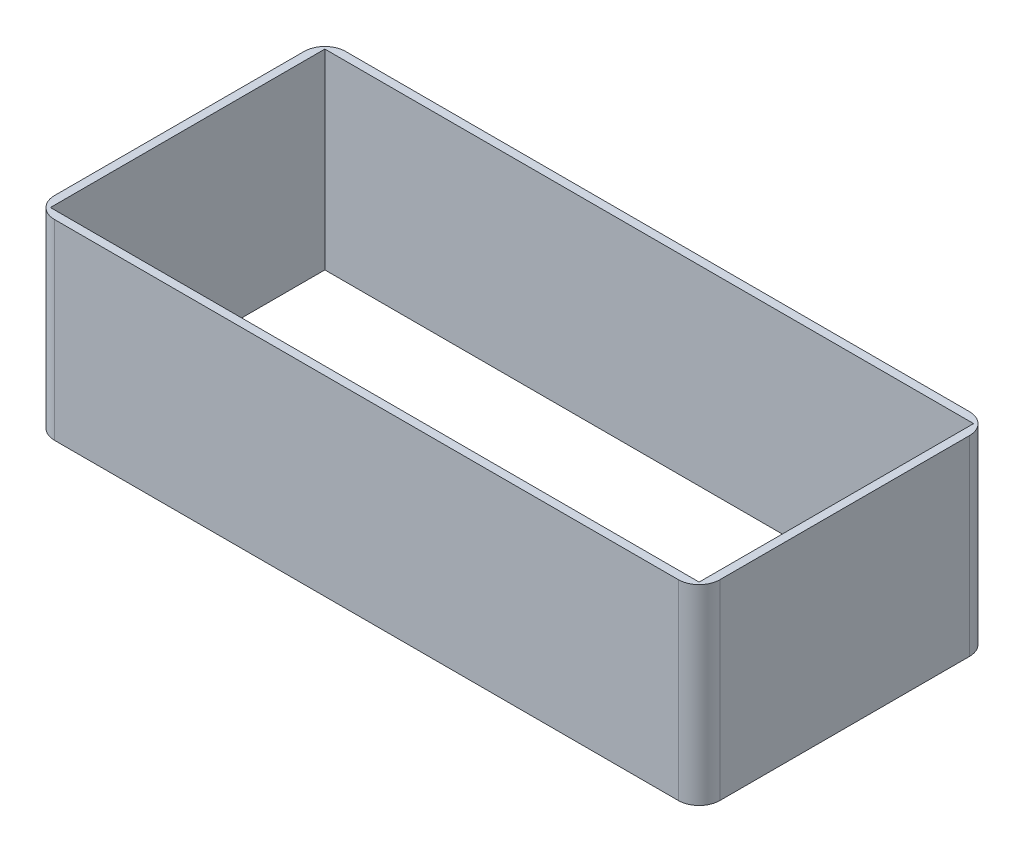
ISO-10303-21;
HEADER;
FILE_DESCRIPTION(('STEP AP214'),'2;1');
FILE_NAME('part.step','',(''),(''),'','','');
FILE_SCHEMA(('AUTOMOTIVE_DESIGN { 1 0 10303 214 1 1 1 1 }'));
ENDSEC;
DATA;
#1=APPLICATION_CONTEXT('core data for automotive mechanical design processes');
#2=APPLICATION_PROTOCOL_DEFINITION('international standard','automotive_design',2000,#1);
#3=PRODUCT_CONTEXT('',#1,'mechanical');
#4=PRODUCT('Part','Part','',(#3));
#5=PRODUCT_RELATED_PRODUCT_CATEGORY('part','',(#4));
#6=PRODUCT_DEFINITION_FORMATION('','',#4);
#7=PRODUCT_DEFINITION_CONTEXT('part definition',#1,'design');
#8=PRODUCT_DEFINITION('design','',#6,#7);
#9=PRODUCT_DEFINITION_SHAPE('','',#8);
#10=(LENGTH_UNIT() NAMED_UNIT(*) SI_UNIT(.MILLI.,.METRE.));
#11=(NAMED_UNIT(*) PLANE_ANGLE_UNIT() SI_UNIT($,.RADIAN.));
#12=(NAMED_UNIT(*) SI_UNIT($,.STERADIAN.) SOLID_ANGLE_UNIT());
#13=UNCERTAINTY_MEASURE_WITH_UNIT(LENGTH_MEASURE(1.E-05),#10,'distance_accuracy_value','');
#14=(GEOMETRIC_REPRESENTATION_CONTEXT(3) GLOBAL_UNCERTAINTY_ASSIGNED_CONTEXT((#13)) GLOBAL_UNIT_ASSIGNED_CONTEXT((#10,
#11,#12)) REPRESENTATION_CONTEXT('',''));
#15=CARTESIAN_POINT('',(0.,0.,0.));
#16=DIRECTION('',(0.,0.,1.));
#17=DIRECTION('',(1.,0.,0.));
#18=AXIS2_PLACEMENT_3D('',#15,#16,#17);
#19=CARTESIAN_POINT('',(0.,2.,0.));
#20=DIRECTION('',(0.,-1.,0.));
#21=DIRECTION('',(0.,0.,-1.));
#22=AXIS2_PLACEMENT_3D('',#19,#20,#21);
#23=PLANE('',#22);
#24=DIRECTION('',(1.,0.,0.));
#25=VECTOR('',#24,1.);
#26=CARTESIAN_POINT('',(-98.3544303797468,2.,20.1518987341772));
#27=LINE('',#26,#25);
#28=CARTESIAN_POINT('',(-96.3544303797468,2.,20.1518987341772));
#29=VERTEX_POINT('',#28);
#30=CARTESIAN_POINT('',(59.6455696202532,2.,20.1518987341772));
#31=VERTEX_POINT('',#30);
#32=EDGE_CURVE('E145',#29,#31,#27,.T.);
#33=ORIENTED_EDGE('',*,*,#32,.T.);
#34=DIRECTION('',(0.,0.,-1.));
#35=VECTOR('',#34,1.);
#36=CARTESIAN_POINT('',(59.6455696202532,2.,-47.8481012658228));
#37=LINE('',#36,#35);
#38=CARTESIAN_POINT('',(59.6455696202532,2.,-45.8481012658228));
#39=VERTEX_POINT('',#38);
#40=EDGE_CURVE('E129',#31,#39,#37,.T.);
#41=ORIENTED_EDGE('',*,*,#40,.T.);
#42=DIRECTION('',(-1.,0.,0.));
#43=VECTOR('',#42,1.);
#44=CARTESIAN_POINT('',(-98.3544303797468,2.,-45.8481012658228));
#45=LINE('',#44,#43);
#46=CARTESIAN_POINT('',(-96.3544303797468,2.,-45.8481012658228));
#47=VERTEX_POINT('',#46);
#48=EDGE_CURVE('E135',#39,#47,#45,.T.);
#49=ORIENTED_EDGE('',*,*,#48,.T.);
#50=DIRECTION('',(0.,0.,1.));
#51=VECTOR('',#50,1.);
#52=CARTESIAN_POINT('',(-96.3544303797468,2.,-47.8481012658228));
#53=LINE('',#52,#51);
#54=EDGE_CURVE('E147',#47,#29,#53,.T.);
#55=ORIENTED_EDGE('',*,*,#54,.T.);
#56=EDGE_LOOP('',(#33,#41,#49,#55));
#57=FACE_BOUND('',#56,.T.);
#58=CARTESIAN_POINT('',(-93.3544303797468,2.,-42.8481012658228));
#59=DIRECTION('',(0.,-1.,0.));
#60=DIRECTION('',(0.,0.,-1.));
#61=AXIS2_PLACEMENT_3D('',#58,#59,#60);
#62=CIRCLE('',#61,5.);
#63=CARTESIAN_POINT('',(-93.3544303797468,2.,-47.8481012658228));
#64=VERTEX_POINT('',#63);
#65=CARTESIAN_POINT('',(-98.3544303797468,2.,-42.8481012658228));
#66=VERTEX_POINT('',#65);
#67=EDGE_CURVE('E198',#64,#66,#62,.F.);
#68=ORIENTED_EDGE('',*,*,#67,.F.);
#69=DIRECTION('',(1.,0.,0.));
#70=VECTOR('',#69,1.);
#71=CARTESIAN_POINT('',(-98.3544303797468,2.,-47.8481012658228));
#72=LINE('',#71,#70);
#73=CARTESIAN_POINT('',(56.6455696202532,2.,-47.8481012658228));
#74=VERTEX_POINT('',#73);
#75=EDGE_CURVE('E141',#64,#74,#72,.T.);
#76=ORIENTED_EDGE('',*,*,#75,.T.);
#77=CARTESIAN_POINT('',(56.6455696202532,2.,-42.8481012658228));
#78=DIRECTION('',(0.,-1.,0.));
#79=DIRECTION('',(0.,0.,-1.));
#80=AXIS2_PLACEMENT_3D('',#77,#78,#79);
#81=CIRCLE('',#80,5.);
#82=CARTESIAN_POINT('',(61.6455696202532,2.,-42.8481012658228));
#83=VERTEX_POINT('',#82);
#84=EDGE_CURVE('E201',#83,#74,#81,.F.);
#85=ORIENTED_EDGE('',*,*,#84,.F.);
#86=DIRECTION('',(0.,0.,1.));
#87=VECTOR('',#86,1.);
#88=CARTESIAN_POINT('',(61.6455696202532,2.,-47.8481012658228));
#89=LINE('',#88,#87);
#90=CARTESIAN_POINT('',(61.6455696202532,2.,17.1518987341772));
#91=VERTEX_POINT('',#90);
#92=EDGE_CURVE('E181',#83,#91,#89,.T.);
#93=ORIENTED_EDGE('',*,*,#92,.T.);
#94=CARTESIAN_POINT('',(56.6455696202532,2.,17.1518987341772));
#95=DIRECTION('',(0.,-1.,0.));
#96=DIRECTION('',(0.,0.,-1.));
#97=AXIS2_PLACEMENT_3D('',#94,#95,#96);
#98=CIRCLE('',#97,5.);
#99=CARTESIAN_POINT('',(56.6455696202532,2.,22.1518987341772));
#100=VERTEX_POINT('',#99);
#101=EDGE_CURVE('E177',#100,#91,#98,.F.);
#102=ORIENTED_EDGE('',*,*,#101,.F.);
#103=DIRECTION('',(-1.,0.,0.));
#104=VECTOR('',#103,1.);
#105=CARTESIAN_POINT('',(-98.3544303797468,2.,22.1518987341772));
#106=LINE('',#105,#104);
#107=CARTESIAN_POINT('',(-93.3544303797468,2.,22.1518987341772));
#108=VERTEX_POINT('',#107);
#109=EDGE_CURVE('E189',#100,#108,#106,.T.);
#110=ORIENTED_EDGE('',*,*,#109,.T.);
#111=CARTESIAN_POINT('',(-93.3544303797468,2.,17.1518987341772));
#112=DIRECTION('',(0.,-1.,0.));
#113=DIRECTION('',(0.,0.,-1.));
#114=AXIS2_PLACEMENT_3D('',#111,#112,#113);
#115=CIRCLE('',#114,5.);
#116=CARTESIAN_POINT('',(-98.3544303797468,2.,17.1518987341772));
#117=VERTEX_POINT('',#116);
#118=EDGE_CURVE('E195',#117,#108,#115,.F.);
#119=ORIENTED_EDGE('',*,*,#118,.F.);
#120=DIRECTION('',(0.,0.,-1.));
#121=VECTOR('',#120,1.);
#122=CARTESIAN_POINT('',(-98.3544303797468,2.,-47.8481012658228));
#123=LINE('',#122,#121);
#124=EDGE_CURVE('E185',#117,#66,#123,.T.);
#125=ORIENTED_EDGE('',*,*,#124,.T.);
#126=EDGE_LOOP('',(#68,#76,#85,#93,#102,#110,#119,#125));
#127=FACE_BOUND('',#126,.T.);
#128=ADVANCED_FACE('F35',(#57,#127),#23,.T.);
#129=CARTESIAN_POINT('',(0.,48.,0.));
#130=DIRECTION('',(0.,1.,0.));
#131=DIRECTION('',(0.,0.,1.));
#132=AXIS2_PLACEMENT_3D('',#129,#130,#131);
#133=PLANE('',#132);
#134=DIRECTION('',(0.,0.,1.));
#135=VECTOR('',#134,1.);
#136=CARTESIAN_POINT('',(-96.3544303797468,48.,-47.8481012658228));
#137=LINE('',#136,#135);
#138=CARTESIAN_POINT('',(-96.3544303797468,48.,-45.8481012658228));
#139=VERTEX_POINT('',#138);
#140=CARTESIAN_POINT('',(-96.3544303797468,48.,20.1518987341772));
#141=VERTEX_POINT('',#140);
#142=EDGE_CURVE('E155',#139,#141,#137,.T.);
#143=ORIENTED_EDGE('',*,*,#142,.F.);
#144=DIRECTION('',(-1.,0.,0.));
#145=VECTOR('',#144,1.);
#146=CARTESIAN_POINT('',(-98.3544303797468,48.,-45.8481012658228));
#147=LINE('',#146,#145);
#148=CARTESIAN_POINT('',(59.6455696202532,48.,-45.8481012658228));
#149=VERTEX_POINT('',#148);
#150=EDGE_CURVE('E39',#149,#139,#147,.T.);
#151=ORIENTED_EDGE('',*,*,#150,.F.);
#152=DIRECTION('',(0.,0.,-1.));
#153=VECTOR('',#152,1.);
#154=CARTESIAN_POINT('',(59.6455696202532,48.,-47.8481012658228));
#155=LINE('',#154,#153);
#156=CARTESIAN_POINT('',(59.6455696202532,48.,20.1518987341772));
#157=VERTEX_POINT('',#156);
#158=EDGE_CURVE('E52',#157,#149,#155,.T.);
#159=ORIENTED_EDGE('',*,*,#158,.F.);
#160=DIRECTION('',(1.,0.,0.));
#161=VECTOR('',#160,1.);
#162=CARTESIAN_POINT('',(-98.3544303797468,48.,20.1518987341772));
#163=LINE('',#162,#161);
#164=EDGE_CURVE('E56',#141,#157,#163,.T.);
#165=ORIENTED_EDGE('',*,*,#164,.F.);
#166=EDGE_LOOP('',(#143,#151,#159,#165));
#167=FACE_BOUND('',#166,.T.);
#168=CARTESIAN_POINT('',(-93.3544303797468,48.,-42.8481012658228));
#169=DIRECTION('',(0.,1.,0.));
#170=DIRECTION('',(0.,0.,1.));
#171=AXIS2_PLACEMENT_3D('',#168,#169,#170);
#172=CIRCLE('',#171,5.);
#173=CARTESIAN_POINT('',(-98.3544303797468,48.,-42.8481012658228));
#174=VERTEX_POINT('',#173);
#175=CARTESIAN_POINT('',(-93.3544303797468,48.,-47.8481012658228));
#176=VERTEX_POINT('',#175);
#177=EDGE_CURVE('E196',#174,#176,#172,.F.);
#178=ORIENTED_EDGE('',*,*,#177,.F.);
#179=DIRECTION('',(0.,0.,1.));
#180=VECTOR('',#179,1.);
#181=CARTESIAN_POINT('',(-98.3544303797468,48.,-47.8481012658228));
#182=LINE('',#181,#180);
#183=CARTESIAN_POINT('',(-98.3544303797468,48.,17.1518987341772));
#184=VERTEX_POINT('',#183);
#185=EDGE_CURVE('E186',#174,#184,#182,.T.);
#186=ORIENTED_EDGE('',*,*,#185,.T.);
#187=CARTESIAN_POINT('',(-93.3544303797468,48.,17.1518987341772));
#188=DIRECTION('',(0.,1.,0.));
#189=DIRECTION('',(0.,0.,1.));
#190=AXIS2_PLACEMENT_3D('',#187,#188,#189);
#191=CIRCLE('',#190,5.);
#192=CARTESIAN_POINT('',(-93.3544303797468,48.,22.1518987341772));
#193=VERTEX_POINT('',#192);
#194=EDGE_CURVE('E193',#193,#184,#191,.F.);
#195=ORIENTED_EDGE('',*,*,#194,.F.);
#196=DIRECTION('',(1.,0.,0.));
#197=VECTOR('',#196,1.);
#198=CARTESIAN_POINT('',(-98.3544303797468,48.,22.1518987341772));
#199=LINE('',#198,#197);
#200=CARTESIAN_POINT('',(56.6455696202532,48.,22.1518987341772));
#201=VERTEX_POINT('',#200);
#202=EDGE_CURVE('E190',#193,#201,#199,.T.);
#203=ORIENTED_EDGE('',*,*,#202,.T.);
#204=CARTESIAN_POINT('',(56.6455696202532,48.,17.1518987341772));
#205=DIRECTION('',(0.,1.,0.));
#206=DIRECTION('',(0.,0.,1.));
#207=AXIS2_PLACEMENT_3D('',#204,#205,#206);
#208=CIRCLE('',#207,5.);
#209=CARTESIAN_POINT('',(61.6455696202532,48.,17.1518987341772));
#210=VERTEX_POINT('',#209);
#211=EDGE_CURVE('E202',#210,#201,#208,.F.);
#212=ORIENTED_EDGE('',*,*,#211,.F.);
#213=DIRECTION('',(0.,0.,-1.));
#214=VECTOR('',#213,1.);
#215=CARTESIAN_POINT('',(61.6455696202532,48.,-47.8481012658228));
#216=LINE('',#215,#214);
#217=CARTESIAN_POINT('',(61.6455696202532,48.,-42.8481012658228));
#218=VERTEX_POINT('',#217);
#219=EDGE_CURVE('E182',#210,#218,#216,.T.);
#220=ORIENTED_EDGE('',*,*,#219,.T.);
#221=CARTESIAN_POINT('',(56.6455696202532,48.,-42.8481012658228));
#222=DIRECTION('',(0.,1.,0.));
#223=DIRECTION('',(0.,0.,1.));
#224=AXIS2_PLACEMENT_3D('',#221,#222,#223);
#225=CIRCLE('',#224,5.);
#226=CARTESIAN_POINT('',(56.6455696202532,48.,-47.8481012658228));
#227=VERTEX_POINT('',#226);
#228=EDGE_CURVE('E199',#227,#218,#225,.F.);
#229=ORIENTED_EDGE('',*,*,#228,.F.);
#230=DIRECTION('',(-1.,0.,0.));
#231=VECTOR('',#230,1.);
#232=CARTESIAN_POINT('',(-98.3544303797468,48.,-47.8481012658228));
#233=LINE('',#232,#231);
#234=EDGE_CURVE('E178',#227,#176,#233,.T.);
#235=ORIENTED_EDGE('',*,*,#234,.T.);
#236=EDGE_LOOP('',(#178,#186,#195,#203,#212,#220,#229,#235));
#237=FACE_BOUND('',#236,.T.);
#238=ADVANCED_FACE('F240',(#167,#237),#133,.T.);
#239=CARTESIAN_POINT('',(-98.3544303797468,48.,-45.8481012658228));
#240=DIRECTION('',(0.,0.,1.));
#241=DIRECTION('',(1.,0.,0.));
#242=AXIS2_PLACEMENT_3D('',#239,#240,#241);
#243=PLANE('',#242);
#244=ORIENTED_EDGE('',*,*,#48,.F.);
#245=DIRECTION('',(0.,-1.,0.));
#246=VECTOR('',#245,1.);
#247=CARTESIAN_POINT('',(59.6455696202532,48.,-45.8481012658228));
#248=LINE('',#247,#246);
#249=EDGE_CURVE('E124',#149,#39,#248,.T.);
#250=ORIENTED_EDGE('',*,*,#249,.F.);
#251=ORIENTED_EDGE('',*,*,#150,.T.);
#252=DIRECTION('',(0.,-1.,0.));
#253=VECTOR('',#252,1.);
#254=CARTESIAN_POINT('',(-96.3544303797468,48.,-45.8481012658228));
#255=LINE('',#254,#253);
#256=EDGE_CURVE('E132',#139,#47,#255,.T.);
#257=ORIENTED_EDGE('',*,*,#256,.T.);
#258=EDGE_LOOP('',(#244,#250,#251,#257));
#259=FACE_BOUND('',#258,.T.);
#260=ADVANCED_FACE('F136',(#259),#243,.T.);
#261=CARTESIAN_POINT('',(59.6455696202532,48.,-47.8481012658228));
#262=DIRECTION('',(-1.,0.,0.));
#263=DIRECTION('',(0.,0.,1.));
#264=AXIS2_PLACEMENT_3D('',#261,#262,#263);
#265=PLANE('',#264);
#266=ORIENTED_EDGE('',*,*,#40,.F.);
#267=DIRECTION('',(0.,-1.,0.));
#268=VECTOR('',#267,1.);
#269=CARTESIAN_POINT('',(59.6455696202532,48.,20.1518987341772));
#270=LINE('',#269,#268);
#271=EDGE_CURVE('E44',#157,#31,#270,.T.);
#272=ORIENTED_EDGE('',*,*,#271,.F.);
#273=ORIENTED_EDGE('',*,*,#158,.T.);
#274=ORIENTED_EDGE('',*,*,#249,.T.);
#275=EDGE_LOOP('',(#266,#272,#273,#274));
#276=FACE_BOUND('',#275,.T.);
#277=ADVANCED_FACE('F126',(#276),#265,.T.);
#278=CARTESIAN_POINT('',(-96.3544303797468,48.,-47.8481012658228));
#279=DIRECTION('',(1.,0.,0.));
#280=DIRECTION('',(0.,0.,-1.));
#281=AXIS2_PLACEMENT_3D('',#278,#279,#280);
#282=PLANE('',#281);
#283=ORIENTED_EDGE('',*,*,#54,.F.);
#284=ORIENTED_EDGE('',*,*,#256,.F.);
#285=ORIENTED_EDGE('',*,*,#142,.T.);
#286=DIRECTION('',(0.,-1.,0.));
#287=VECTOR('',#286,1.);
#288=CARTESIAN_POINT('',(-96.3544303797468,48.,20.1518987341772));
#289=LINE('',#288,#287);
#290=EDGE_CURVE('E11',#141,#29,#289,.T.);
#291=ORIENTED_EDGE('',*,*,#290,.T.);
#292=EDGE_LOOP('',(#283,#284,#285,#291));
#293=FACE_BOUND('',#292,.T.);
#294=ADVANCED_FACE('F265',(#293),#282,.T.);
#295=CARTESIAN_POINT('',(-98.3544303797468,48.,20.1518987341772));
#296=DIRECTION('',(0.,0.,-1.));
#297=DIRECTION('',(-1.,0.,0.));
#298=AXIS2_PLACEMENT_3D('',#295,#296,#297);
#299=PLANE('',#298);
#300=ORIENTED_EDGE('',*,*,#32,.F.);
#301=ORIENTED_EDGE('',*,*,#290,.F.);
#302=ORIENTED_EDGE('',*,*,#164,.T.);
#303=ORIENTED_EDGE('',*,*,#271,.T.);
#304=EDGE_LOOP('',(#300,#301,#302,#303));
#305=FACE_BOUND('',#304,.T.);
#306=ADVANCED_FACE('F269',(#305),#299,.T.);
#307=CARTESIAN_POINT('',(-98.3544303797468,50.,22.1518987341772));
#308=DIRECTION('',(0.,0.,-1.));
#309=DIRECTION('',(-1.,0.,0.));
#310=AXIS2_PLACEMENT_3D('',#307,#308,#309);
#311=PLANE('',#310);
#312=ORIENTED_EDGE('',*,*,#202,.F.);
#313=DIRECTION('',(0.,-1.,0.));
#314=VECTOR('',#313,1.);
#315=CARTESIAN_POINT('',(-93.3544303797468,50.,22.1518987341772));
#316=LINE('',#315,#314);
#317=EDGE_CURVE('E156',#193,#108,#316,.T.);
#318=ORIENTED_EDGE('',*,*,#317,.T.);
#319=ORIENTED_EDGE('',*,*,#109,.F.);
#320=DIRECTION('',(0.,-1.,0.));
#321=VECTOR('',#320,1.);
#322=CARTESIAN_POINT('',(56.6455696202532,50.,22.1518987341772));
#323=LINE('',#322,#321);
#324=EDGE_CURVE('E152',#100,#201,#323,.F.);
#325=ORIENTED_EDGE('',*,*,#324,.T.);
#326=EDGE_LOOP('',(#312,#318,#319,#325));
#327=FACE_BOUND('',#326,.T.);
#328=ADVANCED_FACE('F237',(#327),#311,.F.);
#329=CARTESIAN_POINT('',(61.6455696202532,50.,-47.8481012658228));
#330=DIRECTION('',(-1.,0.,0.));
#331=DIRECTION('',(0.,0.,1.));
#332=AXIS2_PLACEMENT_3D('',#329,#330,#331);
#333=PLANE('',#332);
#334=ORIENTED_EDGE('',*,*,#219,.F.);
#335=DIRECTION('',(0.,-1.,0.));
#336=VECTOR('',#335,1.);
#337=CARTESIAN_POINT('',(61.6455696202532,50.,17.1518987341772));
#338=LINE('',#337,#336);
#339=EDGE_CURVE('E171',#210,#91,#338,.T.);
#340=ORIENTED_EDGE('',*,*,#339,.T.);
#341=ORIENTED_EDGE('',*,*,#92,.F.);
#342=DIRECTION('',(0.,-1.,0.));
#343=VECTOR('',#342,1.);
#344=CARTESIAN_POINT('',(61.6455696202532,50.,-42.8481012658228));
#345=LINE('',#344,#343);
#346=EDGE_CURVE('E174',#83,#218,#345,.F.);
#347=ORIENTED_EDGE('',*,*,#346,.T.);
#348=EDGE_LOOP('',(#334,#340,#341,#347));
#349=FACE_BOUND('',#348,.T.);
#350=ADVANCED_FACE('F230',(#349),#333,.F.);
#351=CARTESIAN_POINT('',(56.6455696202532,50.,17.1518987341772));
#352=DIRECTION('',(0.,-1.,0.));
#353=DIRECTION('',(0.,0.,-1.));
#354=AXIS2_PLACEMENT_3D('',#351,#352,#353);
#355=CYLINDRICAL_SURFACE('',#354,5.);
#356=ORIENTED_EDGE('',*,*,#339,.F.);
#357=ORIENTED_EDGE('',*,*,#211,.T.);
#358=ORIENTED_EDGE('',*,*,#324,.F.);
#359=ORIENTED_EDGE('',*,*,#101,.T.);
#360=EDGE_LOOP('',(#356,#357,#358,#359));
#361=FACE_BOUND('',#360,.T.);
#362=ADVANCED_FACE('F37',(#361),#355,.T.);
#363=CARTESIAN_POINT('',(-98.3544303797468,50.,-47.8481012658228));
#364=DIRECTION('',(0.,0.,1.));
#365=DIRECTION('',(1.,0.,0.));
#366=AXIS2_PLACEMENT_3D('',#363,#364,#365);
#367=PLANE('',#366);
#368=ORIENTED_EDGE('',*,*,#234,.F.);
#369=DIRECTION('',(0.,-1.,0.));
#370=VECTOR('',#369,1.);
#371=CARTESIAN_POINT('',(56.6455696202532,50.,-47.8481012658228));
#372=LINE('',#371,#370);
#373=EDGE_CURVE('E165',#227,#74,#372,.T.);
#374=ORIENTED_EDGE('',*,*,#373,.T.);
#375=ORIENTED_EDGE('',*,*,#75,.F.);
#376=DIRECTION('',(0.,-1.,0.));
#377=VECTOR('',#376,1.);
#378=CARTESIAN_POINT('',(-93.3544303797468,50.,-47.8481012658228));
#379=LINE('',#378,#377);
#380=EDGE_CURVE('E168',#64,#176,#379,.F.);
#381=ORIENTED_EDGE('',*,*,#380,.T.);
#382=EDGE_LOOP('',(#368,#374,#375,#381));
#383=FACE_BOUND('',#382,.T.);
#384=ADVANCED_FACE('F224',(#383),#367,.F.);
#385=CARTESIAN_POINT('',(56.6455696202532,50.,-42.8481012658228));
#386=DIRECTION('',(0.,-1.,0.));
#387=DIRECTION('',(0.,0.,-1.));
#388=AXIS2_PLACEMENT_3D('',#385,#386,#387);
#389=CYLINDRICAL_SURFACE('',#388,5.);
#390=ORIENTED_EDGE('',*,*,#373,.F.);
#391=ORIENTED_EDGE('',*,*,#228,.T.);
#392=ORIENTED_EDGE('',*,*,#346,.F.);
#393=ORIENTED_EDGE('',*,*,#84,.T.);
#394=EDGE_LOOP('',(#390,#391,#392,#393));
#395=FACE_BOUND('',#394,.T.);
#396=ADVANCED_FACE('F226',(#395),#389,.T.);
#397=CARTESIAN_POINT('',(-98.3544303797468,50.,-47.8481012658228));
#398=DIRECTION('',(1.,0.,0.));
#399=DIRECTION('',(0.,0.,-1.));
#400=AXIS2_PLACEMENT_3D('',#397,#398,#399);
#401=PLANE('',#400);
#402=ORIENTED_EDGE('',*,*,#185,.F.);
#403=DIRECTION('',(0.,-1.,0.));
#404=VECTOR('',#403,1.);
#405=CARTESIAN_POINT('',(-98.3544303797468,50.,-42.8481012658228));
#406=LINE('',#405,#404);
#407=EDGE_CURVE('E159',#174,#66,#406,.T.);
#408=ORIENTED_EDGE('',*,*,#407,.T.);
#409=ORIENTED_EDGE('',*,*,#124,.F.);
#410=DIRECTION('',(0.,-1.,0.));
#411=VECTOR('',#410,1.);
#412=CARTESIAN_POINT('',(-98.3544303797468,50.,17.1518987341772));
#413=LINE('',#412,#411);
#414=EDGE_CURVE('E162',#117,#184,#413,.F.);
#415=ORIENTED_EDGE('',*,*,#414,.T.);
#416=EDGE_LOOP('',(#402,#408,#409,#415));
#417=FACE_BOUND('',#416,.T.);
#418=ADVANCED_FACE('F247',(#417),#401,.F.);
#419=CARTESIAN_POINT('',(-93.3544303797468,50.,-42.8481012658228));
#420=DIRECTION('',(0.,-1.,0.));
#421=DIRECTION('',(0.,0.,-1.));
#422=AXIS2_PLACEMENT_3D('',#419,#420,#421);
#423=CYLINDRICAL_SURFACE('',#422,5.);
#424=ORIENTED_EDGE('',*,*,#407,.F.);
#425=ORIENTED_EDGE('',*,*,#177,.T.);
#426=ORIENTED_EDGE('',*,*,#380,.F.);
#427=ORIENTED_EDGE('',*,*,#67,.T.);
#428=EDGE_LOOP('',(#424,#425,#426,#427));
#429=FACE_BOUND('',#428,.T.);
#430=ADVANCED_FACE('F250',(#429),#423,.T.);
#431=CARTESIAN_POINT('',(-93.3544303797468,50.,17.1518987341772));
#432=DIRECTION('',(0.,-1.,0.));
#433=DIRECTION('',(0.,0.,-1.));
#434=AXIS2_PLACEMENT_3D('',#431,#432,#433);
#435=CYLINDRICAL_SURFACE('',#434,5.);
#436=ORIENTED_EDGE('',*,*,#317,.F.);
#437=ORIENTED_EDGE('',*,*,#194,.T.);
#438=ORIENTED_EDGE('',*,*,#414,.F.);
#439=ORIENTED_EDGE('',*,*,#118,.T.);
#440=EDGE_LOOP('',(#436,#437,#438,#439));
#441=FACE_BOUND('',#440,.T.);
#442=ADVANCED_FACE('F242',(#441),#435,.T.);
#443=CLOSED_SHELL('',(#128,#238,#260,#277,#294,#306,#328,#350,#362,#384,#396,#418,#430,#442));
#444=MANIFOLD_SOLID_BREP('B2',#443);
#445=ADVANCED_BREP_SHAPE_REPRESENTATION('',(#18,#444),#14);
#446=SHAPE_DEFINITION_REPRESENTATION(#9,#445);
ENDSEC;
END-ISO-10303-21;
